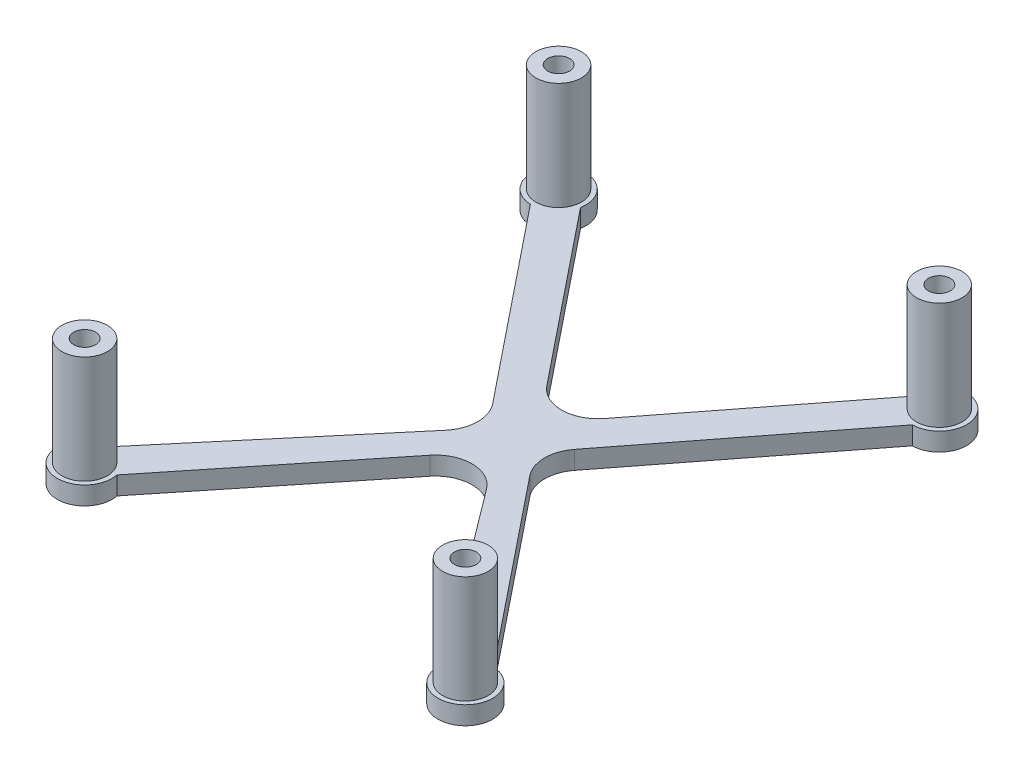
ISO-10303-21;
HEADER;
FILE_DESCRIPTION(('STEP AP214'),'2;1');
FILE_NAME('part.step','',(''),(''),'','','');
FILE_SCHEMA(('AUTOMOTIVE_DESIGN { 1 0 10303 214 1 1 1 1 }'));
ENDSEC;
DATA;
#1=APPLICATION_CONTEXT('core data for automotive mechanical design processes');
#2=APPLICATION_PROTOCOL_DEFINITION('international standard','automotive_design',2000,#1);
#3=PRODUCT_CONTEXT('',#1,'mechanical');
#4=PRODUCT('Part','Part','',(#3));
#5=PRODUCT_RELATED_PRODUCT_CATEGORY('part','',(#4));
#6=PRODUCT_DEFINITION_FORMATION('','',#4);
#7=PRODUCT_DEFINITION_CONTEXT('part definition',#1,'design');
#8=PRODUCT_DEFINITION('design','',#6,#7);
#9=PRODUCT_DEFINITION_SHAPE('','',#8);
#10=(LENGTH_UNIT() NAMED_UNIT(*) SI_UNIT(.MILLI.,.METRE.));
#11=(NAMED_UNIT(*) PLANE_ANGLE_UNIT() SI_UNIT($,.RADIAN.));
#12=(NAMED_UNIT(*) SI_UNIT($,.STERADIAN.) SOLID_ANGLE_UNIT());
#13=UNCERTAINTY_MEASURE_WITH_UNIT(LENGTH_MEASURE(1.E-05),#10,'distance_accuracy_value','');
#14=(GEOMETRIC_REPRESENTATION_CONTEXT(3) GLOBAL_UNCERTAINTY_ASSIGNED_CONTEXT((#13)) GLOBAL_UNIT_ASSIGNED_CONTEXT((#10,
#11,#12)) REPRESENTATION_CONTEXT('',''));
#15=CARTESIAN_POINT('',(0.,0.,0.));
#16=DIRECTION('',(0.,0.,1.));
#17=DIRECTION('',(1.,0.,0.));
#18=AXIS2_PLACEMENT_3D('',#15,#16,#17);
#19=CARTESIAN_POINT('',(-54.0577441671547,-17.5399996647255,-41.9833048927978));
#20=DIRECTION('',(-0.789788214129337,0.,-0.613379635154602));
#21=DIRECTION('',(-0.613379635154602,0.,0.789788214129337));
#22=AXIS2_PLACEMENT_3D('',#19,#20,#21);
#23=PLANE('',#22);
#24=DIRECTION('',(-0.613379635154602,0.,0.789788214129337));
#25=VECTOR('',#24,1.);
#26=CARTESIAN_POINT('',(-54.0577441671547,-14.9999996647255,-41.9833048927978));
#27=LINE('',#26,#25);
#28=CARTESIAN_POINT('',(-98.14684874696,-14.9999996647258,14.7858689971527));
#29=VERTEX_POINT('',#28);
#30=CARTESIAN_POINT('',(-118.732237125704,-14.9999996647259,41.2916350725284));
#31=VERTEX_POINT('',#30);
#32=EDGE_CURVE('E186',#29,#31,#27,.T.);
#33=ORIENTED_EDGE('',*,*,#32,.T.);
#34=DIRECTION('',(0.,1.,0.));
#35=VECTOR('',#34,1.);
#36=CARTESIAN_POINT('',(-118.732237125704,-17.5399996647259,41.2916350725284));
#37=LINE('',#36,#35);
#38=CARTESIAN_POINT('',(-118.732237125704,-17.5399996647259,41.2916350725284));
#39=VERTEX_POINT('',#38);
#40=EDGE_CURVE('E256',#39,#31,#37,.T.);
#41=ORIENTED_EDGE('',*,*,#40,.F.);
#42=DIRECTION('',(-0.613379635154602,0.,0.789788214129337));
#43=VECTOR('',#42,1.);
#44=CARTESIAN_POINT('',(-54.0577441671547,-17.5399996647255,-41.9833048927978));
#45=LINE('',#44,#43);
#46=CARTESIAN_POINT('',(-98.14684874696,-17.5399996647258,14.7858689971527));
#47=VERTEX_POINT('',#46);
#48=EDGE_CURVE('E228',#47,#39,#45,.T.);
#49=ORIENTED_EDGE('',*,*,#48,.F.);
#50=DIRECTION('',(0.,1.,0.));
#51=VECTOR('',#50,1.);
#52=CARTESIAN_POINT('',(-98.14684874696,-17.5399996647258,14.7858689971527));
#53=LINE('',#52,#51);
#54=EDGE_CURVE('E182',#47,#29,#53,.T.);
#55=ORIENTED_EDGE('',*,*,#54,.T.);
#56=EDGE_LOOP('',(#33,#41,#49,#55));
#57=FACE_BOUND('',#56,.T.);
#58=ADVANCED_FACE('F42',(#57),#23,.F.);
#59=CARTESIAN_POINT('',(-114.720112997927,-17.5399996647258,44.4076036191138));
#60=DIRECTION('',(0.,1.,0.));
#61=DIRECTION('',(-1.,0.,0.));
#62=AXIS2_PLACEMENT_3D('',#59,#60,#61);
#63=CYLINDRICAL_SURFACE('',#62,5.08000000000001);
#64=CARTESIAN_POINT('',(-114.720112997927,-14.9999996647258,44.4076036191138));
#65=DIRECTION('',(0.,-1.,0.));
#66=DIRECTION('',(1.,0.,0.));
#67=AXIS2_PLACEMENT_3D('',#64,#65,#66);
#68=CIRCLE('',#67,5.08000000000001);
#69=CARTESIAN_POINT('',(-118.680603619696,-14.9999996647259,47.5889420221896));
#70=VERTEX_POINT('',#69);
#71=EDGE_CURVE('E189',#31,#70,#68,.F.);
#72=ORIENTED_EDGE('',*,*,#71,.T.);
#73=DIRECTION('',(0.,1.,0.));
#74=VECTOR('',#73,1.);
#75=CARTESIAN_POINT('',(-118.680603619696,-17.5399996647259,47.5889420221896));
#76=LINE('',#75,#74);
#77=CARTESIAN_POINT('',(-118.680603619696,-17.5399996647259,47.5889420221896));
#78=VERTEX_POINT('',#77);
#79=EDGE_CURVE('E253',#78,#70,#76,.T.);
#80=ORIENTED_EDGE('',*,*,#79,.F.);
#81=CARTESIAN_POINT('',(-114.720112997927,-17.5399996647258,44.4076036191138));
#82=DIRECTION('',(0.,-1.,0.));
#83=DIRECTION('',(1.,0.,0.));
#84=AXIS2_PLACEMENT_3D('',#81,#82,#83);
#85=CIRCLE('',#84,5.08000000000001);
#86=EDGE_CURVE('E122',#39,#78,#85,.F.);
#87=ORIENTED_EDGE('',*,*,#86,.F.);
#88=ORIENTED_EDGE('',*,*,#40,.T.);
#89=EDGE_LOOP('',(#72,#80,#87,#88));
#90=FACE_BOUND('',#89,.T.);
#91=ADVANCED_FACE('F294',(#90),#63,.F.);
#92=CARTESIAN_POINT('',(-95.3704303954007,-17.5399996647258,76.6080876614453));
#93=DIRECTION('',(-0.779624138143371,0.,0.626247717140914));
#94=DIRECTION('',(0.626247717140914,0.,0.779624138143371));
#95=AXIS2_PLACEMENT_3D('',#92,#93,#94);
#96=PLANE('',#95);
#97=DIRECTION('',(0.626247717140914,0.,0.779624138143371));
#98=VECTOR('',#97,1.);
#99=CARTESIAN_POINT('',(-95.3704303954007,-14.9999996647258,76.6080876614453));
#100=LINE('',#99,#98);
#101=CARTESIAN_POINT('',(-98.0691427738863,-14.9999996647258,73.2484246166374));
#102=VERTEX_POINT('',#101);
#103=EDGE_CURVE('E192',#70,#102,#100,.T.);
#104=ORIENTED_EDGE('',*,*,#103,.T.);
#105=DIRECTION('',(0.,1.,0.));
#106=VECTOR('',#105,1.);
#107=CARTESIAN_POINT('',(-98.0691427738863,-17.5399996647258,73.2484246166374));
#108=LINE('',#107,#106);
#109=CARTESIAN_POINT('',(-98.0691427738863,-17.5399996647258,73.2484246166374));
#110=VERTEX_POINT('',#109);
#111=EDGE_CURVE('E251',#110,#102,#108,.T.);
#112=ORIENTED_EDGE('',*,*,#111,.F.);
#113=DIRECTION('',(0.626247717140914,0.,0.779624138143371));
#114=VECTOR('',#113,1.);
#115=CARTESIAN_POINT('',(-95.3704303954007,-17.5399996647258,76.6080876614453));
#116=LINE('',#115,#114);
#117=EDGE_CURVE('E799',#78,#110,#116,.T.);
#118=ORIENTED_EDGE('',*,*,#117,.F.);
#119=ORIENTED_EDGE('',*,*,#79,.T.);
#120=EDGE_LOOP('',(#104,#112,#118,#119));
#121=FACE_BOUND('',#120,.T.);
#122=ADVANCED_FACE('F298',(#121),#96,.F.);
#123=CARTESIAN_POINT('',(-98.1986724197905,-17.5399996647258,77.056222152068));
#124=DIRECTION('',(0.,1.,0.));
#125=DIRECTION('',(-1.,0.,0.));
#126=AXIS2_PLACEMENT_3D('',#123,#124,#125);
#127=CYLINDRICAL_SURFACE('',#126,3.81);
#128=CARTESIAN_POINT('',(-98.1986724197905,-14.9999996647258,77.056222152068));
#129=DIRECTION('',(0.,-1.,0.));
#130=DIRECTION('',(1.,0.,0.));
#131=AXIS2_PLACEMENT_3D('',#128,#129,#130);
#132=CIRCLE('',#131,3.81);
#133=CARTESIAN_POINT('',(-101.944824248517,-14.9999996647258,76.3616384809914));
#134=VERTEX_POINT('',#133);
#135=EDGE_CURVE('E195',#134,#102,#132,.F.);
#136=ORIENTED_EDGE('',*,*,#135,.F.);
#137=DIRECTION('',(0.,1.,0.));
#138=VECTOR('',#137,1.);
#139=CARTESIAN_POINT('',(-101.944824248517,-17.5399996647258,76.3616384809914));
#140=LINE('',#139,#138);
#141=CARTESIAN_POINT('',(-101.944824248517,-17.5399996647258,76.3616384809914));
#142=VERTEX_POINT('',#141);
#143=EDGE_CURVE('E249',#142,#134,#140,.T.);
#144=ORIENTED_EDGE('',*,*,#143,.F.);
#145=CARTESIAN_POINT('',(-98.1986724197905,-17.5399996647258,77.056222152068));
#146=DIRECTION('',(0.,-1.,0.));
#147=DIRECTION('',(1.,0.,0.));
#148=AXIS2_PLACEMENT_3D('',#145,#146,#147);
#149=CIRCLE('',#148,3.81);
#150=EDGE_CURVE('E801',#142,#110,#149,.F.);
#151=ORIENTED_EDGE('',*,*,#150,.T.);
#152=ORIENTED_EDGE('',*,*,#111,.T.);
#153=EDGE_LOOP('',(#136,#144,#151,#152));
#154=FACE_BOUND('',#153,.T.);
#155=ADVANCED_FACE('F302',(#154),#127,.T.);
#156=CARTESIAN_POINT('',(-101.83097150658,-17.5399996647258,76.5131645013266));
#157=DIRECTION('',(-0.79947234719843,0.,0.600702893338323));
#158=DIRECTION('',(0.600702893338323,0.,0.799472347198431));
#159=AXIS2_PLACEMENT_3D('',#156,#157,#158);
#160=PLANE('',#159);
#161=DIRECTION('',(0.600702893338323,0.,0.799472347198431));
#162=VECTOR('',#161,1.);
#163=CARTESIAN_POINT('',(-101.83097150658,-14.9999996647258,76.5131645013266));
#164=LINE('',#163,#162);
#165=CARTESIAN_POINT('',(-120.087244283391,-14.9999996647259,52.2159862958751));
#166=VERTEX_POINT('',#165);
#167=EDGE_CURVE('E198',#166,#134,#164,.T.);
#168=ORIENTED_EDGE('',*,*,#167,.F.);
#169=DIRECTION('',(0.,1.,0.));
#170=VECTOR('',#169,1.);
#171=CARTESIAN_POINT('',(-120.087244283391,-17.5399996647259,52.2159862958751));
#172=LINE('',#171,#170);
#173=CARTESIAN_POINT('',(-120.087244283391,-17.5399996647259,52.2159862958751));
#174=VERTEX_POINT('',#173);
#175=EDGE_CURVE('E247',#174,#166,#172,.T.);
#176=ORIENTED_EDGE('',*,*,#175,.F.);
#177=DIRECTION('',(0.600702893338323,0.,0.799472347198431));
#178=VECTOR('',#177,1.);
#179=CARTESIAN_POINT('',(-101.83097150658,-17.5399996647258,76.5131645013266));
#180=LINE('',#179,#178);
#181=EDGE_CURVE('E804',#174,#142,#180,.T.);
#182=ORIENTED_EDGE('',*,*,#181,.T.);
#183=ORIENTED_EDGE('',*,*,#143,.T.);
#184=EDGE_LOOP('',(#168,#176,#182,#183));
#185=FACE_BOUND('',#184,.T.);
#186=ADVANCED_FACE('F308',(#185),#160,.T.);
#187=CARTESIAN_POINT('',(-124.148563807159,-17.5399996647259,55.2675569940338));
#188=DIRECTION('',(0.,1.,0.));
#189=DIRECTION('',(-1.,0.,0.));
#190=AXIS2_PLACEMENT_3D('',#187,#188,#189);
#191=CYLINDRICAL_SURFACE('',#190,5.07999999999999);
#192=CARTESIAN_POINT('',(-124.148563807159,-14.9999996647259,55.2675569940338));
#193=DIRECTION('',(0.,-1.,0.));
#194=DIRECTION('',(1.,0.,0.));
#195=AXIS2_PLACEMENT_3D('',#192,#193,#194);
#196=CIRCLE('',#195,5.07999999999999);
#197=CARTESIAN_POINT('',(-128.109054428927,-14.9999996647259,52.086218590958));
#198=VERTEX_POINT('',#197);
#199=EDGE_CURVE('E201',#198,#166,#196,.T.);
#200=ORIENTED_EDGE('',*,*,#199,.F.);
#201=DIRECTION('',(0.,1.,0.));
#202=VECTOR('',#201,1.);
#203=CARTESIAN_POINT('',(-128.109054428927,-17.5399996647259,52.086218590958));
#204=LINE('',#203,#202);
#205=CARTESIAN_POINT('',(-128.109054428927,-17.5399996647259,52.086218590958));
#206=VERTEX_POINT('',#205);
#207=EDGE_CURVE('E245',#206,#198,#204,.T.);
#208=ORIENTED_EDGE('',*,*,#207,.F.);
#209=CARTESIAN_POINT('',(-124.148563807159,-17.5399996647259,55.2675569940338));
#210=DIRECTION('',(0.,-1.,0.));
#211=DIRECTION('',(1.,0.,0.));
#212=AXIS2_PLACEMENT_3D('',#209,#210,#211);
#213=CIRCLE('',#212,5.07999999999999);
#214=EDGE_CURVE('E807',#206,#174,#213,.T.);
#215=ORIENTED_EDGE('',*,*,#214,.T.);
#216=ORIENTED_EDGE('',*,*,#175,.T.);
#217=EDGE_LOOP('',(#200,#208,#215,#216));
#218=FACE_BOUND('',#217,.T.);
#219=ADVANCED_FACE('F312',(#218),#191,.F.);
#220=CARTESIAN_POINT('',(-52.4359880849758,-17.5399996647255,-42.1201912917233));
#221=DIRECTION('',(-0.779624138143377,0.,-0.626247717140907));
#222=DIRECTION('',(-0.626247717140907,0.,0.779624138143377));
#223=AXIS2_PLACEMENT_3D('',#220,#221,#222);
#224=PLANE('',#223);
#225=DIRECTION('',(-0.626247717140907,0.,0.779624138143377));
#226=VECTOR('',#225,1.);
#227=CARTESIAN_POINT('',(-52.4359880849758,-14.9999996647255,-42.1201912917233));
#228=LINE('',#227,#226);
#229=CARTESIAN_POINT('',(-147.547470085056,-14.999999664726,76.285361578608));
#230=VERTEX_POINT('',#229);
#231=EDGE_CURVE('E204',#198,#230,#228,.T.);
#232=ORIENTED_EDGE('',*,*,#231,.T.);
#233=DIRECTION('',(0.,1.,0.));
#234=VECTOR('',#233,1.);
#235=CARTESIAN_POINT('',(-147.547470085056,-17.539999664726,76.285361578608));
#236=LINE('',#235,#234);
#237=CARTESIAN_POINT('',(-147.547470085056,-17.539999664726,76.285361578608));
#238=VERTEX_POINT('',#237);
#239=EDGE_CURVE('E242',#238,#230,#236,.T.);
#240=ORIENTED_EDGE('',*,*,#239,.F.);
#241=DIRECTION('',(-0.626247717140907,0.,0.779624138143377));
#242=VECTOR('',#241,1.);
#243=CARTESIAN_POINT('',(-52.4359880849758,-17.5399996647255,-42.1201912917233));
#244=LINE('',#243,#242);
#245=EDGE_CURVE('E810',#206,#238,#244,.T.);
#246=ORIENTED_EDGE('',*,*,#245,.F.);
#247=ORIENTED_EDGE('',*,*,#207,.T.);
#248=EDGE_LOOP('',(#232,#240,#246,#247));
#249=FACE_BOUND('',#248,.T.);
#250=ADVANCED_FACE('F316',(#249),#224,.F.);
#251=CARTESIAN_POINT('',(-151.278672837023,-17.5399996647261,77.056222152068));
#252=DIRECTION('',(0.,1.,0.));
#253=DIRECTION('',(-1.,0.,0.));
#254=AXIS2_PLACEMENT_3D('',#251,#252,#253);
#255=CYLINDRICAL_SURFACE('',#254,3.81);
#256=CARTESIAN_POINT('',(-151.278672837023,-14.9999996647261,77.056222152068));
#257=DIRECTION('',(0.,-1.,0.));
#258=DIRECTION('',(1.,0.,0.));
#259=AXIS2_PLACEMENT_3D('',#256,#257,#258);
#260=CIRCLE('',#259,3.81);
#261=CARTESIAN_POINT('',(-151.330496509854,-14.9999996647261,73.2465746215301));
#262=VERTEX_POINT('',#261);
#263=EDGE_CURVE('E206',#230,#262,#260,.T.);
#264=ORIENTED_EDGE('',*,*,#263,.T.);
#265=DIRECTION('',(0.,1.,0.));
#266=VECTOR('',#265,1.);
#267=CARTESIAN_POINT('',(-151.330496509854,-17.5399996647261,73.2465746215301));
#268=LINE('',#267,#266);
#269=CARTESIAN_POINT('',(-151.330496509854,-17.5399996647261,73.2465746215301));
#270=VERTEX_POINT('',#269);
#271=EDGE_CURVE('E240',#270,#262,#268,.T.);
#272=ORIENTED_EDGE('',*,*,#271,.F.);
#273=CARTESIAN_POINT('',(-151.278672837023,-17.5399996647261,77.056222152068));
#274=DIRECTION('',(0.,-1.,0.));
#275=DIRECTION('',(1.,0.,0.));
#276=AXIS2_PLACEMENT_3D('',#273,#274,#275);
#277=CIRCLE('',#276,3.81);
#278=EDGE_CURVE('E812',#238,#270,#277,.T.);
#279=ORIENTED_EDGE('',*,*,#278,.F.);
#280=ORIENTED_EDGE('',*,*,#239,.T.);
#281=EDGE_LOOP('',(#264,#272,#279,#280));
#282=FACE_BOUND('',#281,.T.);
#283=ADVANCED_FACE('F320',(#282),#255,.T.);
#284=CARTESIAN_POINT('',(-52.3661683004579,-17.5399996647255,-44.1458147035686));
#285=DIRECTION('',(-0.7645658713106,0.,-0.644545598407951));
#286=DIRECTION('',(-0.644545598407951,0.,0.7645658713106));
#287=AXIS2_PLACEMENT_3D('',#284,#285,#286);
#288=PLANE('',#287);
#289=DIRECTION('',(-0.644545598407951,0.,0.7645658713106));
#290=VECTOR('',#289,1.);
#291=CARTESIAN_POINT('',(-52.366168300458,-14.9999996647255,-44.1458147035686));
#292=LINE('',#291,#290);
#293=CARTESIAN_POINT('',(-130.017313743561,-14.9999996647259,47.9646827082776));
#294=VERTEX_POINT('',#293);
#295=EDGE_CURVE('E209',#294,#262,#292,.T.);
#296=ORIENTED_EDGE('',*,*,#295,.F.);
#297=DIRECTION('',(0.,1.,0.));
#298=VECTOR('',#297,1.);
#299=CARTESIAN_POINT('',(-130.017313743561,-17.5399996647259,47.9646827082776));
#300=LINE('',#299,#298);
#301=CARTESIAN_POINT('',(-130.017313743561,-17.5399996647259,47.9646827082776));
#302=VERTEX_POINT('',#301);
#303=EDGE_CURVE('E238',#302,#294,#300,.T.);
#304=ORIENTED_EDGE('',*,*,#303,.F.);
#305=DIRECTION('',(-0.644545598407951,0.,0.7645658713106));
#306=VECTOR('',#305,1.);
#307=CARTESIAN_POINT('',(-52.3661683004579,-17.5399996647255,-44.1458147035686));
#308=LINE('',#307,#306);
#309=EDGE_CURVE('E814',#302,#270,#308,.T.);
#310=ORIENTED_EDGE('',*,*,#309,.T.);
#311=ORIENTED_EDGE('',*,*,#271,.T.);
#312=EDGE_LOOP('',(#296,#304,#310,#311));
#313=FACE_BOUND('',#312,.T.);
#314=ADVANCED_FACE('F324',(#313),#288,.T.);
#315=CARTESIAN_POINT('',(-133.901308369819,-17.539999664726,44.6903910683652));
#316=DIRECTION('',(0.,1.,0.));
#317=DIRECTION('',(-1.,0.,0.));
#318=AXIS2_PLACEMENT_3D('',#315,#316,#317);
#319=CYLINDRICAL_SURFACE('',#318,5.07999999999998);
#320=CARTESIAN_POINT('',(-133.901308369819,-14.999999664726,44.6903910683652));
#321=DIRECTION('',(0.,-1.,0.));
#322=DIRECTION('',(1.,0.,0.));
#323=AXIS2_PLACEMENT_3D('',#320,#321,#322);
#324=CIRCLE('',#323,5.07999999999998);
#325=CARTESIAN_POINT('',(-129.940817748051,-14.9999996647259,41.5090526652894));
#326=VERTEX_POINT('',#325);
#327=EDGE_CURVE('E212',#326,#294,#324,.T.);
#328=ORIENTED_EDGE('',*,*,#327,.F.);
#329=DIRECTION('',(0.,1.,0.));
#330=VECTOR('',#329,1.);
#331=CARTESIAN_POINT('',(-129.940817748051,-17.5399996647259,41.5090526652894));
#332=LINE('',#331,#330);
#333=CARTESIAN_POINT('',(-129.940817748051,-17.5399996647259,41.5090526652894));
#334=VERTEX_POINT('',#333);
#335=EDGE_CURVE('E236',#334,#326,#332,.T.);
#336=ORIENTED_EDGE('',*,*,#335,.F.);
#337=CARTESIAN_POINT('',(-133.901308369819,-17.539999664726,44.6903910683652));
#338=DIRECTION('',(0.,-1.,0.));
#339=DIRECTION('',(1.,0.,0.));
#340=AXIS2_PLACEMENT_3D('',#337,#338,#339);
#341=CIRCLE('',#340,5.07999999999998);
#342=EDGE_CURVE('E817',#334,#302,#341,.T.);
#343=ORIENTED_EDGE('',*,*,#342,.T.);
#344=ORIENTED_EDGE('',*,*,#303,.T.);
#345=EDGE_LOOP('',(#328,#336,#343,#344));
#346=FACE_BOUND('',#345,.T.);
#347=ADVANCED_FACE('F328',(#346),#319,.F.);
#348=CARTESIAN_POINT('',(-99.2461118700318,-17.5399996647258,79.7213015257994));
#349=DIRECTION('',(-0.779624138143371,0.,0.626247717140913));
#350=DIRECTION('',(0.626247717140913,0.,0.779624138143372));
#351=AXIS2_PLACEMENT_3D('',#348,#349,#350);
#352=PLANE('',#351);
#353=DIRECTION('',(0.626247717140913,0.,0.779624138143371));
#354=VECTOR('',#353,1.);
#355=CARTESIAN_POINT('',(-99.2461118700318,-14.9999996647258,79.7213015257994));
#356=LINE('',#355,#354);
#357=CARTESIAN_POINT('',(-151.408202482928,-14.999999664726,14.7840190020453));
#358=VERTEX_POINT('',#357);
#359=EDGE_CURVE('E215',#358,#326,#356,.T.);
#360=ORIENTED_EDGE('',*,*,#359,.F.);
#361=DIRECTION('',(0.,1.,0.));
#362=VECTOR('',#361,1.);
#363=CARTESIAN_POINT('',(-151.408202482928,-17.539999664726,14.7840190020453));
#364=LINE('',#363,#362);
#365=CARTESIAN_POINT('',(-151.408202482928,-17.539999664726,14.7840190020453));
#366=VERTEX_POINT('',#365);
#367=EDGE_CURVE('E234',#366,#358,#364,.T.);
#368=ORIENTED_EDGE('',*,*,#367,.F.);
#369=DIRECTION('',(0.626247717140913,0.,0.779624138143371));
#370=VECTOR('',#369,1.);
#371=CARTESIAN_POINT('',(-99.2461118700318,-17.5399996647258,79.7213015257994));
#372=LINE('',#371,#370);
#373=EDGE_CURVE('E820',#366,#334,#372,.T.);
#374=ORIENTED_EDGE('',*,*,#373,.T.);
#375=ORIENTED_EDGE('',*,*,#335,.T.);
#376=EDGE_LOOP('',(#360,#368,#374,#375));
#377=FACE_BOUND('',#376,.T.);
#378=ADVANCED_FACE('F332',(#377),#352,.T.);
#379=CARTESIAN_POINT('',(-151.278672837023,-17.539999664726,10.9762214666147));
#380=DIRECTION('',(0.,1.,0.));
#381=DIRECTION('',(-1.,0.,0.));
#382=AXIS2_PLACEMENT_3D('',#379,#380,#381);
#383=CYLINDRICAL_SURFACE('',#382,3.81);
#384=CARTESIAN_POINT('',(-151.278672837023,-14.999999664726,10.9762214666147));
#385=DIRECTION('',(0.,-1.,0.));
#386=DIRECTION('',(1.,0.,0.));
#387=AXIS2_PLACEMENT_3D('',#384,#385,#386);
#388=CIRCLE('',#387,3.81);
#389=CARTESIAN_POINT('',(-147.532521008296,-14.999999664726,11.670805137692));
#390=VERTEX_POINT('',#389);
#391=EDGE_CURVE('E218',#390,#358,#388,.F.);
#392=ORIENTED_EDGE('',*,*,#391,.F.);
#393=DIRECTION('',(0.,1.,0.));
#394=VECTOR('',#393,1.);
#395=CARTESIAN_POINT('',(-147.532521008296,-17.539999664726,11.670805137692));
#396=LINE('',#395,#394);
#397=CARTESIAN_POINT('',(-147.532521008296,-17.539999664726,11.670805137692));
#398=VERTEX_POINT('',#397);
#399=EDGE_CURVE('E232',#398,#390,#396,.T.);
#400=ORIENTED_EDGE('',*,*,#399,.F.);
#401=CARTESIAN_POINT('',(-151.278672837023,-17.539999664726,10.9762214666147));
#402=DIRECTION('',(0.,-1.,0.));
#403=DIRECTION('',(1.,0.,0.));
#404=AXIS2_PLACEMENT_3D('',#401,#402,#403);
#405=CIRCLE('',#404,3.81);
#406=EDGE_CURVE('E823',#398,#366,#405,.F.);
#407=ORIENTED_EDGE('',*,*,#406,.T.);
#408=ORIENTED_EDGE('',*,*,#367,.T.);
#409=EDGE_LOOP('',(#392,#400,#407,#408));
#410=FACE_BOUND('',#409,.T.);
#411=ADVANCED_FACE('F336',(#410),#383,.T.);
#412=CARTESIAN_POINT('',(-95.3704303954007,-17.5399996647258,76.6080876614453));
#413=DIRECTION('',(-0.779624138143371,0.,0.626247717140914));
#414=DIRECTION('',(0.626247717140914,0.,0.779624138143371));
#415=AXIS2_PLACEMENT_3D('',#412,#413,#414);
#416=PLANE('',#415);
#417=DIRECTION('',(0.626247717140914,0.,0.779624138143371));
#418=VECTOR('',#417,1.);
#419=CARTESIAN_POINT('',(-95.3704303954007,-14.9999996647258,76.6080876614453));
#420=LINE('',#419,#418);
#421=CARTESIAN_POINT('',(-128.344431489876,-14.9999996647259,35.5583137767853));
#422=VERTEX_POINT('',#421);
#423=EDGE_CURVE('E221',#390,#422,#420,.T.);
#424=ORIENTED_EDGE('',*,*,#423,.T.);
#425=DIRECTION('',(0.,1.,0.));
#426=VECTOR('',#425,1.);
#427=CARTESIAN_POINT('',(-128.344431489876,-17.5399996647259,35.5583137767853));
#428=LINE('',#427,#426);
#429=CARTESIAN_POINT('',(-128.344431489876,-17.5399996647259,35.5583137767853));
#430=VERTEX_POINT('',#429);
#431=EDGE_CURVE('E171',#430,#422,#428,.T.);
#432=ORIENTED_EDGE('',*,*,#431,.F.);
#433=DIRECTION('',(0.626247717140914,0.,0.779624138143371));
#434=VECTOR('',#433,1.);
#435=CARTESIAN_POINT('',(-95.3704303954007,-17.5399996647258,76.6080876614453));
#436=LINE('',#435,#434);
#437=EDGE_CURVE('E177',#398,#430,#436,.T.);
#438=ORIENTED_EDGE('',*,*,#437,.F.);
#439=ORIENTED_EDGE('',*,*,#399,.T.);
#440=EDGE_LOOP('',(#424,#432,#438,#439));
#441=FACE_BOUND('',#440,.T.);
#442=ADVANCED_FACE('F340',(#441),#416,.F.);
#443=CARTESIAN_POINT('',(-124.383940868108,-17.5399996647259,32.3769753737095));
#444=DIRECTION('',(0.,1.,0.));
#445=DIRECTION('',(-1.,0.,0.));
#446=AXIS2_PLACEMENT_3D('',#443,#444,#445);
#447=CYLINDRICAL_SURFACE('',#446,5.08);
#448=CARTESIAN_POINT('',(-124.383940868108,-14.9999996647259,32.3769753737095));
#449=DIRECTION('',(0.,-1.,0.));
#450=DIRECTION('',(1.,0.,0.));
#451=AXIS2_PLACEMENT_3D('',#448,#449,#450);
#452=CIRCLE('',#451,5.08);
#453=CARTESIAN_POINT('',(-120.371816740331,-14.9999996647259,35.4929439202949));
#454=VERTEX_POINT('',#453);
#455=EDGE_CURVE('E166',#454,#422,#452,.T.);
#456=ORIENTED_EDGE('',*,*,#455,.F.);
#457=DIRECTION('',(0.,1.,0.));
#458=VECTOR('',#457,1.);
#459=CARTESIAN_POINT('',(-120.371816740331,-17.5399996647259,35.4929439202949));
#460=LINE('',#459,#458);
#461=CARTESIAN_POINT('',(-120.371816740331,-17.5399996647259,35.4929439202949));
#462=VERTEX_POINT('',#461);
#463=EDGE_CURVE('E161',#462,#454,#460,.T.);
#464=ORIENTED_EDGE('',*,*,#463,.F.);
#465=CARTESIAN_POINT('',(-124.383940868108,-17.5399996647259,32.3769753737095));
#466=DIRECTION('',(0.,-1.,0.));
#467=DIRECTION('',(1.,0.,0.));
#468=AXIS2_PLACEMENT_3D('',#465,#466,#467);
#469=CIRCLE('',#468,5.08);
#470=EDGE_CURVE('E164',#462,#430,#469,.T.);
#471=ORIENTED_EDGE('',*,*,#470,.T.);
#472=ORIENTED_EDGE('',*,*,#431,.T.);
#473=EDGE_LOOP('',(#456,#464,#471,#472));
#474=FACE_BOUND('',#473,.T.);
#475=ADVANCED_FACE('F163',(#474),#447,.F.);
#476=CARTESIAN_POINT('',(-57.8895752195509,-17.5399996647255,-44.9592509639657));
#477=DIRECTION('',(-0.789788214129337,0.,-0.613379635154602));
#478=DIRECTION('',(-0.613379635154602,0.,0.789788214129337));
#479=AXIS2_PLACEMENT_3D('',#476,#477,#478);
#480=PLANE('',#479);
#481=DIRECTION('',(-0.613379635154602,0.,0.789788214129337));
#482=VECTOR('',#481,1.);
#483=CARTESIAN_POINT('',(-57.8895752195509,-14.9999996647255,-44.9592509639657));
#484=LINE('',#483,#482);
#485=CARTESIAN_POINT('',(-101.929875171757,-14.9999996647258,11.7470820400744));
#486=VERTEX_POINT('',#485);
#487=EDGE_CURVE('E225',#486,#454,#484,.T.);
#488=ORIENTED_EDGE('',*,*,#487,.F.);
#489=DIRECTION('',(0.,1.,0.));
#490=VECTOR('',#489,1.);
#491=CARTESIAN_POINT('',(-101.929875171757,-17.5399996647258,11.7470820400744));
#492=LINE('',#491,#490);
#493=CARTESIAN_POINT('',(-101.929875171757,-17.5399996647258,11.7470820400744));
#494=VERTEX_POINT('',#493);
#495=EDGE_CURVE('E110',#494,#486,#492,.T.);
#496=ORIENTED_EDGE('',*,*,#495,.F.);
#497=DIRECTION('',(-0.613379635154602,0.,0.789788214129337));
#498=VECTOR('',#497,1.);
#499=CARTESIAN_POINT('',(-57.8895752195509,-17.5399996647255,-44.9592509639657));
#500=LINE('',#499,#498);
#501=EDGE_CURVE('E174',#494,#462,#500,.T.);
#502=ORIENTED_EDGE('',*,*,#501,.T.);
#503=ORIENTED_EDGE('',*,*,#463,.T.);
#504=EDGE_LOOP('',(#488,#496,#502,#503));
#505=FACE_BOUND('',#504,.T.);
#506=ADVANCED_FACE('F180',(#505),#480,.T.);
#507=CARTESIAN_POINT('',(-98.1986724197905,-17.5399996647258,10.9762214666147));
#508=DIRECTION('',(0.,1.,0.));
#509=DIRECTION('',(-1.,0.,0.));
#510=AXIS2_PLACEMENT_3D('',#507,#508,#509);
#511=CYLINDRICAL_SURFACE('',#510,3.81);
#512=CARTESIAN_POINT('',(-98.1986724197905,-14.9999996647258,10.9762214666147));
#513=DIRECTION('',(0.,-1.,0.));
#514=DIRECTION('',(1.,0.,0.));
#515=AXIS2_PLACEMENT_3D('',#512,#513,#514);
#516=CIRCLE('',#515,3.81);
#517=EDGE_CURVE('E113',#486,#29,#516,.T.);
#518=ORIENTED_EDGE('',*,*,#517,.T.);
#519=ORIENTED_EDGE('',*,*,#54,.F.);
#520=CARTESIAN_POINT('',(-98.1986724197905,-17.5399996647258,10.9762214666147));
#521=DIRECTION('',(0.,-1.,0.));
#522=DIRECTION('',(1.,0.,0.));
#523=AXIS2_PLACEMENT_3D('',#520,#521,#522);
#524=CIRCLE('',#523,3.81);
#525=EDGE_CURVE('E58',#494,#47,#524,.T.);
#526=ORIENTED_EDGE('',*,*,#525,.F.);
#527=ORIENTED_EDGE('',*,*,#495,.T.);
#528=EDGE_LOOP('',(#518,#519,#526,#527));
#529=FACE_BOUND('',#528,.T.);
#530=ADVANCED_FACE('F283',(#529),#511,.T.);
#531=CARTESIAN_POINT('',(0.,-17.5399996647252,0.));
#532=DIRECTION('',(0.,-1.,0.));
#533=DIRECTION('',(1.,0.,0.));
#534=AXIS2_PLACEMENT_3D('',#531,#532,#533);
#535=PLANE('',#534);
#536=CARTESIAN_POINT('',(-98.1986724197905,-17.5399996647257,10.9762214666147));
#537=DIRECTION('',(0.,-1.,0.));
#538=DIRECTION('',(0.,0.,-1.));
#539=AXIS2_PLACEMENT_3D('',#536,#537,#538);
#540=CIRCLE('',#539,2.8575);
#541=CARTESIAN_POINT('',(-98.1986724197905,-17.5399996647257,8.11872146661468));
#542=VERTEX_POINT('',#541);
#543=EDGE_CURVE('E740',#542,#542,#540,.T.);
#544=ORIENTED_EDGE('',*,*,#543,.F.);
#545=EDGE_LOOP('',(#544));
#546=FACE_BOUND('',#545,.T.);
#547=CARTESIAN_POINT('',(-98.1986724197905,-17.5399996647258,77.056222152068));
#548=DIRECTION('',(0.,-1.,0.));
#549=DIRECTION('',(0.,0.,-1.));
#550=AXIS2_PLACEMENT_3D('',#547,#548,#549);
#551=CIRCLE('',#550,2.8575);
#552=CARTESIAN_POINT('',(-98.1986724197905,-17.5399996647258,74.198722152068));
#553=VERTEX_POINT('',#552);
#554=EDGE_CURVE('E750',#553,#553,#551,.T.);
#555=ORIENTED_EDGE('',*,*,#554,.F.);
#556=EDGE_LOOP('',(#555));
#557=FACE_BOUND('',#556,.T.);
#558=CARTESIAN_POINT('',(-151.278672837023,-17.5399996647261,77.056222152068));
#559=DIRECTION('',(0.,-1.,0.));
#560=DIRECTION('',(0.,0.,-1.));
#561=AXIS2_PLACEMENT_3D('',#558,#559,#560);
#562=CIRCLE('',#561,2.85750000000001);
#563=CARTESIAN_POINT('',(-151.278672837023,-17.5399996647261,74.198722152068));
#564=VERTEX_POINT('',#563);
#565=EDGE_CURVE('E762',#564,#564,#562,.T.);
#566=ORIENTED_EDGE('',*,*,#565,.F.);
#567=EDGE_LOOP('',(#566));
#568=FACE_BOUND('',#567,.T.);
#569=CARTESIAN_POINT('',(-151.278672837023,-17.539999664726,10.9762214666147));
#570=DIRECTION('',(0.,-1.,0.));
#571=DIRECTION('',(0.,0.,-1.));
#572=AXIS2_PLACEMENT_3D('',#569,#570,#571);
#573=CIRCLE('',#572,2.85750000000001);
#574=CARTESIAN_POINT('',(-151.278672837023,-17.539999664726,8.11872146661466));
#575=VERTEX_POINT('',#574);
#576=EDGE_CURVE('E774',#575,#575,#573,.T.);
#577=ORIENTED_EDGE('',*,*,#576,.F.);
#578=EDGE_LOOP('',(#577));
#579=FACE_BOUND('',#578,.T.);
#580=ORIENTED_EDGE('',*,*,#48,.T.);
#581=ORIENTED_EDGE('',*,*,#86,.T.);
#582=ORIENTED_EDGE('',*,*,#117,.T.);
#583=ORIENTED_EDGE('',*,*,#150,.F.);
#584=ORIENTED_EDGE('',*,*,#181,.F.);
#585=ORIENTED_EDGE('',*,*,#214,.F.);
#586=ORIENTED_EDGE('',*,*,#245,.T.);
#587=ORIENTED_EDGE('',*,*,#278,.T.);
#588=ORIENTED_EDGE('',*,*,#309,.F.);
#589=ORIENTED_EDGE('',*,*,#342,.F.);
#590=ORIENTED_EDGE('',*,*,#373,.F.);
#591=ORIENTED_EDGE('',*,*,#406,.F.);
#592=ORIENTED_EDGE('',*,*,#437,.T.);
#593=ORIENTED_EDGE('',*,*,#470,.F.);
#594=ORIENTED_EDGE('',*,*,#501,.F.);
#595=ORIENTED_EDGE('',*,*,#525,.T.);
#596=EDGE_LOOP('',(#580,#581,#582,#583,#584,#585,#586,#587,#588,#589,#590,#591,#592,#593,#594,#595));
#597=FACE_BOUND('',#596,.T.);
#598=ADVANCED_FACE('F173',(#546,#557,#568,#579,#597),#535,.T.);
#599=CARTESIAN_POINT('',(0.,-14.9999996647252,0.));
#600=DIRECTION('',(0.,-1.,0.));
#601=DIRECTION('',(1.,0.,0.));
#602=AXIS2_PLACEMENT_3D('',#599,#600,#601);
#603=PLANE('',#602);
#604=CARTESIAN_POINT('',(-98.1986724197905,-14.9999996647258,77.056222152068));
#605=DIRECTION('',(0.,-1.,0.));
#606=DIRECTION('',(1.,0.,0.));
#607=AXIS2_PLACEMENT_3D('',#604,#605,#606);
#608=CIRCLE('',#607,3.175);
#609=CARTESIAN_POINT('',(-95.0236724197905,-14.9999996647257,77.056222152068));
#610=VERTEX_POINT('',#609);
#611=EDGE_CURVE('E11',#610,#610,#608,.F.);
#612=ORIENTED_EDGE('',*,*,#611,.F.);
#613=EDGE_LOOP('',(#612));
#614=FACE_BOUND('',#613,.T.);
#615=CARTESIAN_POINT('',(-151.278672837023,-14.9999996647261,77.056222152068));
#616=DIRECTION('',(0.,-1.,0.));
#617=DIRECTION('',(1.,0.,0.));
#618=AXIS2_PLACEMENT_3D('',#615,#616,#617);
#619=CIRCLE('',#618,3.175);
#620=CARTESIAN_POINT('',(-148.103672837023,-14.999999664726,77.056222152068));
#621=VERTEX_POINT('',#620);
#622=EDGE_CURVE('E50',#621,#621,#619,.F.);
#623=ORIENTED_EDGE('',*,*,#622,.F.);
#624=EDGE_LOOP('',(#623));
#625=FACE_BOUND('',#624,.T.);
#626=CARTESIAN_POINT('',(-151.278672837023,-14.999999664726,10.9762214666147));
#627=DIRECTION('',(0.,-1.,0.));
#628=DIRECTION('',(1.,0.,0.));
#629=AXIS2_PLACEMENT_3D('',#626,#627,#628);
#630=CIRCLE('',#629,3.175);
#631=CARTESIAN_POINT('',(-148.103672837023,-14.999999664726,10.9762214666147));
#632=VERTEX_POINT('',#631);
#633=EDGE_CURVE('E261',#632,#632,#630,.F.);
#634=ORIENTED_EDGE('',*,*,#633,.F.);
#635=EDGE_LOOP('',(#634));
#636=FACE_BOUND('',#635,.T.);
#637=CARTESIAN_POINT('',(-98.1986724197905,-14.9999996647257,10.9762214666147));
#638=DIRECTION('',(0.,-1.,0.));
#639=DIRECTION('',(1.,0.,0.));
#640=AXIS2_PLACEMENT_3D('',#637,#638,#639);
#641=CIRCLE('',#640,3.175);
#642=CARTESIAN_POINT('',(-95.0236724197905,-14.9999996647257,10.9762214666147));
#643=VERTEX_POINT('',#642);
#644=EDGE_CURVE('E258',#643,#643,#641,.F.);
#645=ORIENTED_EDGE('',*,*,#644,.F.);
#646=EDGE_LOOP('',(#645));
#647=FACE_BOUND('',#646,.T.);
#648=ORIENTED_EDGE('',*,*,#32,.F.);
#649=ORIENTED_EDGE('',*,*,#517,.F.);
#650=ORIENTED_EDGE('',*,*,#487,.T.);
#651=ORIENTED_EDGE('',*,*,#455,.T.);
#652=ORIENTED_EDGE('',*,*,#423,.F.);
#653=ORIENTED_EDGE('',*,*,#391,.T.);
#654=ORIENTED_EDGE('',*,*,#359,.T.);
#655=ORIENTED_EDGE('',*,*,#327,.T.);
#656=ORIENTED_EDGE('',*,*,#295,.T.);
#657=ORIENTED_EDGE('',*,*,#263,.F.);
#658=ORIENTED_EDGE('',*,*,#231,.F.);
#659=ORIENTED_EDGE('',*,*,#199,.T.);
#660=ORIENTED_EDGE('',*,*,#167,.T.);
#661=ORIENTED_EDGE('',*,*,#135,.T.);
#662=ORIENTED_EDGE('',*,*,#103,.F.);
#663=ORIENTED_EDGE('',*,*,#71,.F.);
#664=EDGE_LOOP('',(#648,#649,#650,#651,#652,#653,#654,#655,#656,#657,#658,#659,#660,#661,#662,#663));
#665=FACE_BOUND('',#664,.T.);
#666=ADVANCED_FACE('F268',(#614,#625,#636,#647,#665),#603,.F.);
#667=CARTESIAN_POINT('',(-98.1986724197906,8.98025612106947,10.9762214666147));
#668=DIRECTION('',(0.,-1.,0.));
#669=DIRECTION('',(1.,0.,0.));
#670=AXIS2_PLACEMENT_3D('',#667,#668,#669);
#671=CYLINDRICAL_SURFACE('',#670,3.175);
#672=CARTESIAN_POINT('',(-98.1986724197906,0.,10.9762214666147));
#673=DIRECTION('',(0.,-1.,0.));
#674=DIRECTION('',(0.,0.,-1.));
#675=AXIS2_PLACEMENT_3D('',#672,#673,#674);
#676=CIRCLE('',#675,3.175);
#677=CARTESIAN_POINT('',(-98.1986724197906,0.,7.80122146661468));
#678=VERTEX_POINT('',#677);
#679=EDGE_CURVE('E190',#678,#678,#676,.T.);
#680=ORIENTED_EDGE('',*,*,#679,.T.);
#681=EDGE_LOOP('',(#680));
#682=FACE_BOUND('',#681,.T.);
#683=ORIENTED_EDGE('',*,*,#644,.T.);
#684=EDGE_LOOP('',(#683));
#685=FACE_BOUND('',#684,.T.);
#686=ADVANCED_FACE('F271',(#682,#685),#671,.T.);
#687=CARTESIAN_POINT('',(-0.137984300772942,0.,0.));
#688=DIRECTION('',(0.,-1.,0.));
#689=DIRECTION('',(0.,0.,-1.));
#690=AXIS2_PLACEMENT_3D('',#687,#688,#689);
#691=PLANE('',#690);
#692=CARTESIAN_POINT('',(-98.1986724197905,3.71230823859037E-13,10.9762214666147));
#693=DIRECTION('',(0.,-1.,0.));
#694=DIRECTION('',(0.,0.,-1.));
#695=AXIS2_PLACEMENT_3D('',#692,#693,#694);
#696=CIRCLE('',#695,1.524);
#697=CARTESIAN_POINT('',(-98.1986724197905,3.71230823859037E-13,9.45222146661468));
#698=VERTEX_POINT('',#697);
#699=EDGE_CURVE('E747',#698,#698,#696,.T.);
#700=ORIENTED_EDGE('',*,*,#699,.T.);
#701=EDGE_LOOP('',(#700));
#702=FACE_BOUND('',#701,.T.);
#703=ORIENTED_EDGE('',*,*,#679,.F.);
#704=EDGE_LOOP('',(#703));
#705=FACE_BOUND('',#704,.T.);
#706=ADVANCED_FACE('F377',(#702,#705),#691,.F.);
#707=CARTESIAN_POINT('',(-151.278672837023,8.98025612106918,10.9762214666147));
#708=DIRECTION('',(0.,-1.,0.));
#709=DIRECTION('',(1.,0.,0.));
#710=AXIS2_PLACEMENT_3D('',#707,#708,#709);
#711=CYLINDRICAL_SURFACE('',#710,3.175);
#712=CARTESIAN_POINT('',(-151.278672837023,0.,10.9762214666147));
#713=DIRECTION('',(0.,-1.,0.));
#714=DIRECTION('',(0.,0.,-1.));
#715=AXIS2_PLACEMENT_3D('',#712,#713,#714);
#716=CIRCLE('',#715,3.175);
#717=CARTESIAN_POINT('',(-151.278672837023,0.,7.80122146661468));
#718=VERTEX_POINT('',#717);
#719=EDGE_CURVE('E792',#718,#718,#716,.T.);
#720=ORIENTED_EDGE('',*,*,#719,.T.);
#721=EDGE_LOOP('',(#720));
#722=FACE_BOUND('',#721,.T.);
#723=ORIENTED_EDGE('',*,*,#633,.T.);
#724=EDGE_LOOP('',(#723));
#725=FACE_BOUND('',#724,.T.);
#726=ADVANCED_FACE('F386',(#722,#725),#711,.T.);
#727=CARTESIAN_POINT('',(-0.137984300772942,0.,0.));
#728=DIRECTION('',(0.,-1.,0.));
#729=DIRECTION('',(0.,0.,-1.));
#730=AXIS2_PLACEMENT_3D('',#727,#728,#729);
#731=PLANE('',#730);
#732=CARTESIAN_POINT('',(-151.278672837023,0.,10.9762214666147));
#733=DIRECTION('',(0.,-1.,0.));
#734=DIRECTION('',(0.,0.,-1.));
#735=AXIS2_PLACEMENT_3D('',#732,#733,#734);
#736=CIRCLE('',#735,1.524);
#737=CARTESIAN_POINT('',(-151.278672837023,0.,9.45222146661467));
#738=VERTEX_POINT('',#737);
#739=EDGE_CURVE('E783',#738,#738,#736,.T.);
#740=ORIENTED_EDGE('',*,*,#739,.T.);
#741=EDGE_LOOP('',(#740));
#742=FACE_BOUND('',#741,.T.);
#743=ORIENTED_EDGE('',*,*,#719,.F.);
#744=EDGE_LOOP('',(#743));
#745=FACE_BOUND('',#744,.T.);
#746=ADVANCED_FACE('F391',(#742,#745),#731,.F.);
#747=CARTESIAN_POINT('',(-151.278672837023,8.98025612106916,77.056222152068));
#748=DIRECTION('',(0.,-1.,0.));
#749=DIRECTION('',(1.,0.,0.));
#750=AXIS2_PLACEMENT_3D('',#747,#748,#749);
#751=CYLINDRICAL_SURFACE('',#750,3.175);
#752=CARTESIAN_POINT('',(-151.278672837023,0.,77.056222152068));
#753=DIRECTION('',(0.,-1.,0.));
#754=DIRECTION('',(0.,0.,-1.));
#755=AXIS2_PLACEMENT_3D('',#752,#753,#754);
#756=CIRCLE('',#755,3.175);
#757=CARTESIAN_POINT('',(-151.278672837023,0.,73.881222152068));
#758=VERTEX_POINT('',#757);
#759=EDGE_CURVE('E789',#758,#758,#756,.T.);
#760=ORIENTED_EDGE('',*,*,#759,.T.);
#761=EDGE_LOOP('',(#760));
#762=FACE_BOUND('',#761,.T.);
#763=ORIENTED_EDGE('',*,*,#622,.T.);
#764=EDGE_LOOP('',(#763));
#765=FACE_BOUND('',#764,.T.);
#766=ADVANCED_FACE('F266',(#762,#765),#751,.T.);
#767=CARTESIAN_POINT('',(-0.137984300772942,0.,0.));
#768=DIRECTION('',(0.,-1.,0.));
#769=DIRECTION('',(0.,0.,-1.));
#770=AXIS2_PLACEMENT_3D('',#767,#768,#769);
#771=PLANE('',#770);
#772=CARTESIAN_POINT('',(-151.278672837023,0.,77.056222152068));
#773=DIRECTION('',(0.,-1.,0.));
#774=DIRECTION('',(0.,0.,-1.));
#775=AXIS2_PLACEMENT_3D('',#772,#773,#774);
#776=CIRCLE('',#775,1.524);
#777=CARTESIAN_POINT('',(-151.278672837023,0.,75.532222152068));
#778=VERTEX_POINT('',#777);
#779=EDGE_CURVE('E771',#778,#778,#776,.T.);
#780=ORIENTED_EDGE('',*,*,#779,.T.);
#781=EDGE_LOOP('',(#780));
#782=FACE_BOUND('',#781,.T.);
#783=ORIENTED_EDGE('',*,*,#759,.F.);
#784=EDGE_LOOP('',(#783));
#785=FACE_BOUND('',#784,.T.);
#786=ADVANCED_FACE('F404',(#782,#785),#771,.F.);
#787=CARTESIAN_POINT('',(-98.1986724197906,8.98025612106945,77.056222152068));
#788=DIRECTION('',(0.,-1.,0.));
#789=DIRECTION('',(1.,0.,0.));
#790=AXIS2_PLACEMENT_3D('',#787,#788,#789);
#791=CYLINDRICAL_SURFACE('',#790,3.175);
#792=CARTESIAN_POINT('',(-98.1986724197906,0.,77.056222152068));
#793=DIRECTION('',(0.,-1.,0.));
#794=DIRECTION('',(0.,0.,-1.));
#795=AXIS2_PLACEMENT_3D('',#792,#793,#794);
#796=CIRCLE('',#795,3.175);
#797=CARTESIAN_POINT('',(-98.1986724197906,0.,73.881222152068));
#798=VERTEX_POINT('',#797);
#799=EDGE_CURVE('E786',#798,#798,#796,.T.);
#800=ORIENTED_EDGE('',*,*,#799,.T.);
#801=EDGE_LOOP('',(#800));
#802=FACE_BOUND('',#801,.T.);
#803=ORIENTED_EDGE('',*,*,#611,.T.);
#804=EDGE_LOOP('',(#803));
#805=FACE_BOUND('',#804,.T.);
#806=ADVANCED_FACE('F413',(#802,#805),#791,.T.);
#807=CARTESIAN_POINT('',(-0.137984300772942,0.,0.));
#808=DIRECTION('',(0.,-1.,0.));
#809=DIRECTION('',(0.,0.,-1.));
#810=AXIS2_PLACEMENT_3D('',#807,#808,#809);
#811=PLANE('',#810);
#812=CARTESIAN_POINT('',(-98.1986724197905,3.50414142147315E-13,77.056222152068));
#813=DIRECTION('',(0.,-1.,0.));
#814=DIRECTION('',(0.,0.,-1.));
#815=AXIS2_PLACEMENT_3D('',#812,#813,#814);
#816=CIRCLE('',#815,1.524);
#817=CARTESIAN_POINT('',(-98.1986724197905,3.50414142147315E-13,75.532222152068));
#818=VERTEX_POINT('',#817);
#819=EDGE_CURVE('E759',#818,#818,#816,.T.);
#820=ORIENTED_EDGE('',*,*,#819,.T.);
#821=EDGE_LOOP('',(#820));
#822=FACE_BOUND('',#821,.T.);
#823=ORIENTED_EDGE('',*,*,#799,.F.);
#824=EDGE_LOOP('',(#823));
#825=FACE_BOUND('',#824,.T.);
#826=ADVANCED_FACE('F418',(#822,#825),#811,.F.);
#827=CARTESIAN_POINT('',(-151.278672837023,-17.539999664726,10.9762214666147));
#828=DIRECTION('',(0.,-1.,0.));
#829=DIRECTION('',(0.,0.,-1.));
#830=AXIS2_PLACEMENT_3D('',#827,#828,#829);
#831=CYLINDRICAL_SURFACE('',#830,1.524);
#832=ORIENTED_EDGE('',*,*,#739,.F.);
#833=EDGE_LOOP('',(#832));
#834=FACE_BOUND('',#833,.T.);
#835=CARTESIAN_POINT('',(-151.278672837023,-12.459999664726,10.9762214666147));
#836=DIRECTION('',(0.,-1.,0.));
#837=DIRECTION('',(0.,0.,-1.));
#838=AXIS2_PLACEMENT_3D('',#835,#836,#837);
#839=CIRCLE('',#838,1.524);
#840=CARTESIAN_POINT('',(-151.278672837023,-12.459999664726,9.45222146661467));
#841=VERTEX_POINT('',#840);
#842=EDGE_CURVE('E780',#841,#841,#839,.T.);
#843=ORIENTED_EDGE('',*,*,#842,.T.);
#844=EDGE_LOOP('',(#843));
#845=FACE_BOUND('',#844,.T.);
#846=ADVANCED_FACE('F435',(#834,#845),#831,.F.);
#847=CARTESIAN_POINT('',(-149.754672837023,-12.459999664726,10.9762214666147));
#848=DIRECTION('',(0.,1.,0.));
#849=DIRECTION('',(0.,0.,1.));
#850=AXIS2_PLACEMENT_3D('',#847,#848,#849);
#851=PLANE('',#850);
#852=ORIENTED_EDGE('',*,*,#842,.F.);
#853=EDGE_LOOP('',(#852));
#854=FACE_BOUND('',#853,.T.);
#855=CARTESIAN_POINT('',(-151.278672837023,-12.459999664726,10.9762214666147));
#856=DIRECTION('',(0.,-1.,0.));
#857=DIRECTION('',(0.,0.,-1.));
#858=AXIS2_PLACEMENT_3D('',#855,#856,#857);
#859=CIRCLE('',#858,2.85749999999998);
#860=CARTESIAN_POINT('',(-151.278672837023,-12.459999664726,8.11872146661468));
#861=VERTEX_POINT('',#860);
#862=EDGE_CURVE('E777',#861,#861,#859,.T.);
#863=ORIENTED_EDGE('',*,*,#862,.T.);
#864=EDGE_LOOP('',(#863));
#865=FACE_BOUND('',#864,.T.);
#866=ADVANCED_FACE('F440',(#854,#865),#851,.F.);
#867=CARTESIAN_POINT('',(-151.278672837023,-17.539999664726,10.9762214666147));
#868=DIRECTION('',(0.,-1.,0.));
#869=DIRECTION('',(0.,0.,-1.));
#870=AXIS2_PLACEMENT_3D('',#867,#868,#869);
#871=CYLINDRICAL_SURFACE('',#870,2.8575);
#872=ORIENTED_EDGE('',*,*,#862,.F.);
#873=EDGE_LOOP('',(#872));
#874=FACE_BOUND('',#873,.T.);
#875=ORIENTED_EDGE('',*,*,#576,.T.);
#876=EDGE_LOOP('',(#875));
#877=FACE_BOUND('',#876,.T.);
#878=ADVANCED_FACE('F451',(#874,#877),#871,.F.);
#879=CARTESIAN_POINT('',(-151.278672837023,-17.5399996647261,77.056222152068));
#880=DIRECTION('',(0.,-1.,0.));
#881=DIRECTION('',(0.,0.,-1.));
#882=AXIS2_PLACEMENT_3D('',#879,#880,#881);
#883=CYLINDRICAL_SURFACE('',#882,1.524);
#884=ORIENTED_EDGE('',*,*,#779,.F.);
#885=EDGE_LOOP('',(#884));
#886=FACE_BOUND('',#885,.T.);
#887=CARTESIAN_POINT('',(-151.278672837023,-12.4599996647261,77.056222152068));
#888=DIRECTION('',(0.,-1.,0.));
#889=DIRECTION('',(0.,0.,-1.));
#890=AXIS2_PLACEMENT_3D('',#887,#888,#889);
#891=CIRCLE('',#890,1.524);
#892=CARTESIAN_POINT('',(-151.278672837023,-12.4599996647261,75.532222152068));
#893=VERTEX_POINT('',#892);
#894=EDGE_CURVE('E768',#893,#893,#891,.T.);
#895=ORIENTED_EDGE('',*,*,#894,.T.);
#896=EDGE_LOOP('',(#895));
#897=FACE_BOUND('',#896,.T.);
#898=ADVANCED_FACE('F462',(#886,#897),#883,.F.);
#899=CARTESIAN_POINT('',(-149.754672837023,-12.4599996647261,77.056222152068));
#900=DIRECTION('',(0.,1.,0.));
#901=DIRECTION('',(0.,0.,1.));
#902=AXIS2_PLACEMENT_3D('',#899,#900,#901);
#903=PLANE('',#902);
#904=ORIENTED_EDGE('',*,*,#894,.F.);
#905=EDGE_LOOP('',(#904));
#906=FACE_BOUND('',#905,.T.);
#907=CARTESIAN_POINT('',(-151.278672837023,-12.4599996647261,77.056222152068));
#908=DIRECTION('',(0.,-1.,0.));
#909=DIRECTION('',(0.,0.,-1.));
#910=AXIS2_PLACEMENT_3D('',#907,#908,#909);
#911=CIRCLE('',#910,2.85749999999998);
#912=CARTESIAN_POINT('',(-151.278672837023,-12.4599996647261,74.198722152068));
#913=VERTEX_POINT('',#912);
#914=EDGE_CURVE('E765',#913,#913,#911,.T.);
#915=ORIENTED_EDGE('',*,*,#914,.T.);
#916=EDGE_LOOP('',(#915));
#917=FACE_BOUND('',#916,.T.);
#918=ADVANCED_FACE('F505',(#906,#917),#903,.F.);
#919=CARTESIAN_POINT('',(-151.278672837023,-17.5399996647261,77.056222152068));
#920=DIRECTION('',(0.,-1.,0.));
#921=DIRECTION('',(0.,0.,-1.));
#922=AXIS2_PLACEMENT_3D('',#919,#920,#921);
#923=CYLINDRICAL_SURFACE('',#922,2.8575);
#924=ORIENTED_EDGE('',*,*,#914,.F.);
#925=EDGE_LOOP('',(#924));
#926=FACE_BOUND('',#925,.T.);
#927=ORIENTED_EDGE('',*,*,#565,.T.);
#928=EDGE_LOOP('',(#927));
#929=FACE_BOUND('',#928,.T.);
#930=ADVANCED_FACE('F516',(#926,#929),#923,.F.);
#931=CARTESIAN_POINT('',(-98.1986724197905,-17.5399996647258,77.056222152068));
#932=DIRECTION('',(0.,-1.,0.));
#933=DIRECTION('',(0.,0.,-1.));
#934=AXIS2_PLACEMENT_3D('',#931,#932,#933);
#935=CYLINDRICAL_SURFACE('',#934,1.524);
#936=ORIENTED_EDGE('',*,*,#819,.F.);
#937=EDGE_LOOP('',(#936));
#938=FACE_BOUND('',#937,.T.);
#939=CARTESIAN_POINT('',(-98.1986724197905,-12.4599996647258,77.056222152068));
#940=DIRECTION('',(0.,-1.,0.));
#941=DIRECTION('',(0.,0.,-1.));
#942=AXIS2_PLACEMENT_3D('',#939,#940,#941);
#943=CIRCLE('',#942,1.524);
#944=CARTESIAN_POINT('',(-98.1986724197905,-12.4599996647258,75.532222152068));
#945=VERTEX_POINT('',#944);
#946=EDGE_CURVE('E756',#945,#945,#943,.T.);
#947=ORIENTED_EDGE('',*,*,#946,.T.);
#948=EDGE_LOOP('',(#947));
#949=FACE_BOUND('',#948,.T.);
#950=ADVANCED_FACE('F527',(#938,#949),#935,.F.);
#951=CARTESIAN_POINT('',(-96.6746724197905,-12.4599996647258,77.056222152068));
#952=DIRECTION('',(0.,1.,0.));
#953=DIRECTION('',(0.,0.,1.));
#954=AXIS2_PLACEMENT_3D('',#951,#952,#953);
#955=PLANE('',#954);
#956=ORIENTED_EDGE('',*,*,#946,.F.);
#957=EDGE_LOOP('',(#956));
#958=FACE_BOUND('',#957,.T.);
#959=CARTESIAN_POINT('',(-98.1986724197905,-12.4599996647258,77.056222152068));
#960=DIRECTION('',(0.,-1.,0.));
#961=DIRECTION('',(0.,0.,-1.));
#962=AXIS2_PLACEMENT_3D('',#959,#960,#961);
#963=CIRCLE('',#962,2.8575);
#964=CARTESIAN_POINT('',(-98.1986724197905,-12.4599996647258,74.198722152068));
#965=VERTEX_POINT('',#964);
#966=EDGE_CURVE('E753',#965,#965,#963,.T.);
#967=ORIENTED_EDGE('',*,*,#966,.T.);
#968=EDGE_LOOP('',(#967));
#969=FACE_BOUND('',#968,.T.);
#970=ADVANCED_FACE('F538',(#958,#969),#955,.F.);
#971=CARTESIAN_POINT('',(-98.1986724197905,-17.5399996647258,77.056222152068));
#972=DIRECTION('',(0.,-1.,0.));
#973=DIRECTION('',(0.,0.,-1.));
#974=AXIS2_PLACEMENT_3D('',#971,#972,#973);
#975=CYLINDRICAL_SURFACE('',#974,2.8575);
#976=ORIENTED_EDGE('',*,*,#966,.F.);
#977=EDGE_LOOP('',(#976));
#978=FACE_BOUND('',#977,.T.);
#979=ORIENTED_EDGE('',*,*,#554,.T.);
#980=EDGE_LOOP('',(#979));
#981=FACE_BOUND('',#980,.T.);
#982=ADVANCED_FACE('F549',(#978,#981),#975,.F.);
#983=CARTESIAN_POINT('',(-98.1986724197905,-17.5399996647257,10.9762214666147));
#984=DIRECTION('',(0.,-1.,0.));
#985=DIRECTION('',(0.,0.,-1.));
#986=AXIS2_PLACEMENT_3D('',#983,#984,#985);
#987=CYLINDRICAL_SURFACE('',#986,1.524);
#988=ORIENTED_EDGE('',*,*,#699,.F.);
#989=EDGE_LOOP('',(#988));
#990=FACE_BOUND('',#989,.T.);
#991=CARTESIAN_POINT('',(-98.1986724197905,-12.4599996647257,10.9762214666147));
#992=DIRECTION('',(0.,-1.,0.));
#993=DIRECTION('',(0.,0.,-1.));
#994=AXIS2_PLACEMENT_3D('',#991,#992,#993);
#995=CIRCLE('',#994,1.524);
#996=CARTESIAN_POINT('',(-98.1986724197905,-12.4599996647257,9.45222146661468));
#997=VERTEX_POINT('',#996);
#998=EDGE_CURVE('E742',#997,#997,#995,.T.);
#999=ORIENTED_EDGE('',*,*,#998,.T.);
#1000=EDGE_LOOP('',(#999));
#1001=FACE_BOUND('',#1000,.T.);
#1002=ADVANCED_FACE('F560',(#990,#1001),#987,.F.);
#1003=CARTESIAN_POINT('',(-96.6746724197905,-12.4599996647257,10.9762214666147));
#1004=DIRECTION('',(0.,1.,0.));
#1005=DIRECTION('',(0.,0.,1.));
#1006=AXIS2_PLACEMENT_3D('',#1003,#1004,#1005);
#1007=PLANE('',#1006);
#1008=ORIENTED_EDGE('',*,*,#998,.F.);
#1009=EDGE_LOOP('',(#1008));
#1010=FACE_BOUND('',#1009,.T.);
#1011=CARTESIAN_POINT('',(-98.1986724197905,-12.4599996647257,10.9762214666147));
#1012=DIRECTION('',(0.,-1.,0.));
#1013=DIRECTION('',(0.,0.,-1.));
#1014=AXIS2_PLACEMENT_3D('',#1011,#1012,#1013);
#1015=CIRCLE('',#1014,2.8575);
#1016=CARTESIAN_POINT('',(-98.1986724197905,-12.4599996647257,8.11872146661468));
#1017=VERTEX_POINT('',#1016);
#1018=EDGE_CURVE('E737',#1017,#1017,#1015,.T.);
#1019=ORIENTED_EDGE('',*,*,#1018,.T.);
#1020=EDGE_LOOP('',(#1019));
#1021=FACE_BOUND('',#1020,.T.);
#1022=ADVANCED_FACE('F571',(#1010,#1021),#1007,.F.);
#1023=CARTESIAN_POINT('',(-98.1986724197905,-17.5399996647257,10.9762214666147));
#1024=DIRECTION('',(0.,-1.,0.));
#1025=DIRECTION('',(0.,0.,-1.));
#1026=AXIS2_PLACEMENT_3D('',#1023,#1024,#1025);
#1027=CYLINDRICAL_SURFACE('',#1026,2.8575);
#1028=ORIENTED_EDGE('',*,*,#1018,.F.);
#1029=EDGE_LOOP('',(#1028));
#1030=FACE_BOUND('',#1029,.T.);
#1031=ORIENTED_EDGE('',*,*,#543,.T.);
#1032=EDGE_LOOP('',(#1031));
#1033=FACE_BOUND('',#1032,.T.);
#1034=ADVANCED_FACE('F582',(#1030,#1033),#1027,.F.);
#1035=CLOSED_SHELL('',(#58,#91,#122,#155,#186,#219,#250,#283,#314,#347,#378,#411,#442,#475,#506,
#530,#598,#666,#686,#706,#726,#746,#766,#786,#806,#826,#846,#866,#878,#898,#918,#930,#950,#970,
#982,#1002,#1022,#1034));
#1036=MANIFOLD_SOLID_BREP('B2',#1035);
#1037=ADVANCED_BREP_SHAPE_REPRESENTATION('',(#18,#1036),#14);
#1038=SHAPE_DEFINITION_REPRESENTATION(#9,#1037);
ENDSEC;
END-ISO-10303-21;
